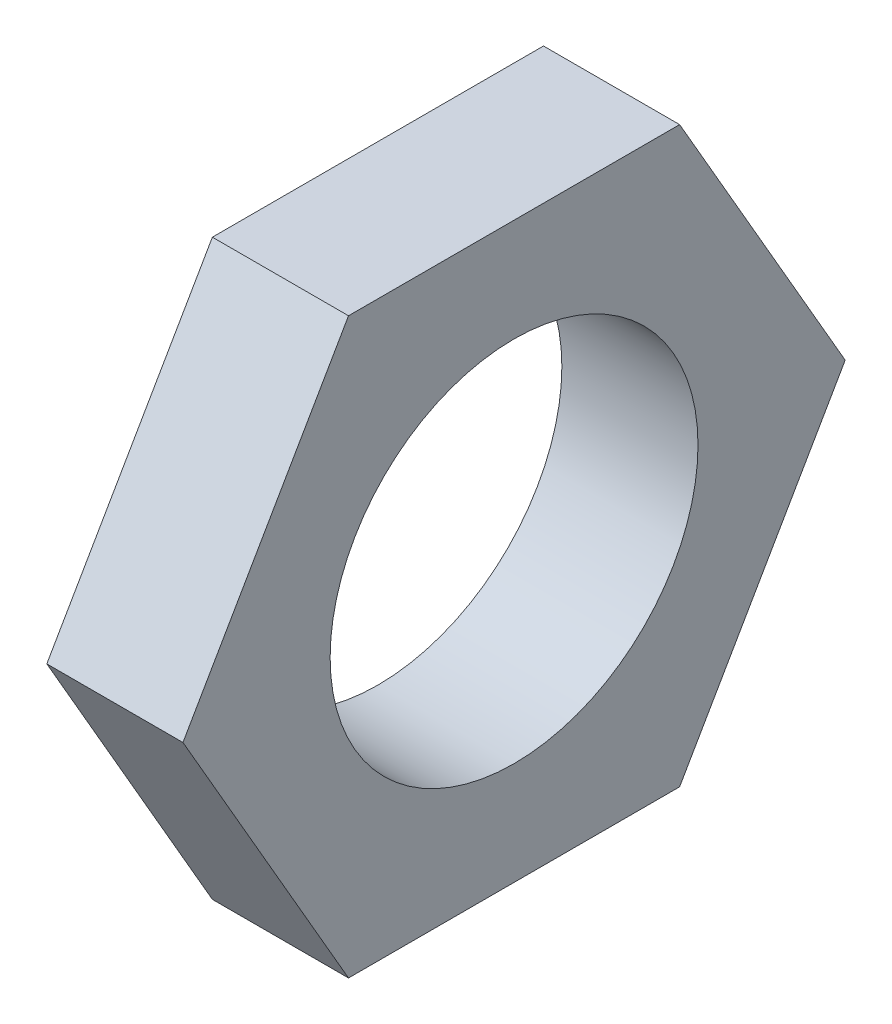
ISO-10303-21;
HEADER;
FILE_DESCRIPTION(('STEP AP214'),'2;1');
FILE_NAME('part.step','',(''),(''),'','','');
FILE_SCHEMA(('AUTOMOTIVE_DESIGN { 1 0 10303 214 1 1 1 1 }'));
ENDSEC;
DATA;
#1=APPLICATION_CONTEXT('core data for automotive mechanical design processes');
#2=APPLICATION_PROTOCOL_DEFINITION('international standard','automotive_design',2000,#1);
#3=PRODUCT_CONTEXT('',#1,'mechanical');
#4=PRODUCT('Part','Part','',(#3));
#5=PRODUCT_RELATED_PRODUCT_CATEGORY('part','',(#4));
#6=PRODUCT_DEFINITION_FORMATION('','',#4);
#7=PRODUCT_DEFINITION_CONTEXT('part definition',#1,'design');
#8=PRODUCT_DEFINITION('design','',#6,#7);
#9=PRODUCT_DEFINITION_SHAPE('','',#8);
#10=(LENGTH_UNIT() NAMED_UNIT(*) SI_UNIT(.MILLI.,.METRE.));
#11=(NAMED_UNIT(*) PLANE_ANGLE_UNIT() SI_UNIT($,.RADIAN.));
#12=(NAMED_UNIT(*) SI_UNIT($,.STERADIAN.) SOLID_ANGLE_UNIT());
#13=UNCERTAINTY_MEASURE_WITH_UNIT(LENGTH_MEASURE(1.E-05),#10,'distance_accuracy_value','');
#14=(GEOMETRIC_REPRESENTATION_CONTEXT(3) GLOBAL_UNCERTAINTY_ASSIGNED_CONTEXT((#13)) GLOBAL_UNIT_ASSIGNED_CONTEXT((#10,
#11,#12)) REPRESENTATION_CONTEXT('',''));
#15=CARTESIAN_POINT('',(0.,0.,0.));
#16=DIRECTION('',(0.,0.,1.));
#17=DIRECTION('',(1.,0.,0.));
#18=AXIS2_PLACEMENT_3D('',#15,#16,#17);
#19=CARTESIAN_POINT('',(2.35,0.,0.));
#20=DIRECTION('',(1.,0.,0.));
#21=DIRECTION('',(0.,0.,-1.));
#22=AXIS2_PLACEMENT_3D('',#19,#20,#21);
#23=PLANE('',#22);
#24=DIRECTION('',(0.,0.866025403784442,-0.499999999999995));
#25=VECTOR('',#24,1.);
#26=CARTESIAN_POINT('',(2.35,-4.94999999999997,-2.85788383248871));
#27=LINE('',#26,#25);
#28=CARTESIAN_POINT('',(2.35,-4.94999999999997,-2.85788383248871));
#29=VERTEX_POINT('',#28);
#30=CARTESIAN_POINT('',(2.35,0.,-5.7157676649773));
#31=VERTEX_POINT('',#30);
#32=EDGE_CURVE('E146',#29,#31,#27,.T.);
#33=ORIENTED_EDGE('',*,*,#32,.T.);
#34=DIRECTION('',(0.,0.866025403784438,0.500000000000001));
#35=VECTOR('',#34,1.);
#36=CARTESIAN_POINT('',(2.35,0.,-5.7157676649773));
#37=LINE('',#36,#35);
#38=CARTESIAN_POINT('',(2.35,4.95000000000001,-2.85788383248864));
#39=VERTEX_POINT('',#38);
#40=EDGE_CURVE('E94',#31,#39,#37,.T.);
#41=ORIENTED_EDGE('',*,*,#40,.T.);
#42=DIRECTION('',(0.,0.,1.));
#43=VECTOR('',#42,1.);
#44=CARTESIAN_POINT('',(2.35,4.95000000000001,-2.85788383248864));
#45=LINE('',#44,#43);
#46=CARTESIAN_POINT('',(2.35,4.94999999999999,2.85788383248867));
#47=VERTEX_POINT('',#46);
#48=EDGE_CURVE('E107',#39,#47,#45,.T.);
#49=ORIENTED_EDGE('',*,*,#48,.T.);
#50=DIRECTION('',(0.,-0.866025403784442,0.499999999999995));
#51=VECTOR('',#50,1.);
#52=CARTESIAN_POINT('',(2.35,4.94999999999999,2.85788383248867));
#53=LINE('',#52,#51);
#54=CARTESIAN_POINT('',(2.35,0.,5.7157676649773));
#55=VERTEX_POINT('',#54);
#56=EDGE_CURVE('E101',#47,#55,#53,.T.);
#57=ORIENTED_EDGE('',*,*,#56,.T.);
#58=DIRECTION('',(0.,-0.866025403784435,-0.500000000000007));
#59=VECTOR('',#58,1.);
#60=CARTESIAN_POINT('',(2.35,0.,5.7157676649773));
#61=LINE('',#60,#59);
#62=CARTESIAN_POINT('',(2.35,-4.95000000000003,2.8578838324886));
#63=VERTEX_POINT('',#62);
#64=EDGE_CURVE('E105',#55,#63,#61,.T.);
#65=ORIENTED_EDGE('',*,*,#64,.T.);
#66=DIRECTION('',(0.,0.,-1.));
#67=VECTOR('',#66,1.);
#68=CARTESIAN_POINT('',(2.35,-4.95000000000003,2.8578838324886));
#69=LINE('',#68,#67);
#70=EDGE_CURVE('E57',#63,#29,#69,.T.);
#71=ORIENTED_EDGE('',*,*,#70,.T.);
#72=EDGE_LOOP('',(#33,#41,#49,#57,#65,#71));
#73=FACE_BOUND('',#72,.T.);
#74=CARTESIAN_POINT('',(2.35,0.,0.));
#75=DIRECTION('',(1.,0.,0.));
#76=DIRECTION('',(0.,0.,-1.));
#77=AXIS2_PLACEMENT_3D('',#74,#75,#76);
#78=CIRCLE('',#77,3.175);
#79=CARTESIAN_POINT('',(2.35,0.,-3.175));
#80=VERTEX_POINT('',#79);
#81=EDGE_CURVE('E134',#80,#80,#78,.T.);
#82=ORIENTED_EDGE('',*,*,#81,.F.);
#83=EDGE_LOOP('',(#82));
#84=FACE_BOUND('',#83,.T.);
#85=ADVANCED_FACE('F39',(#73,#84),#23,.T.);
#86=CARTESIAN_POINT('',(0.,0.,0.));
#87=DIRECTION('',(1.,0.,0.));
#88=DIRECTION('',(0.,0.,-1.));
#89=AXIS2_PLACEMENT_3D('',#86,#87,#88);
#90=PLANE('',#89);
#91=DIRECTION('',(0.,0.866025403784442,-0.499999999999995));
#92=VECTOR('',#91,1.);
#93=CARTESIAN_POINT('',(0.,-4.94999999999997,-2.85788383248871));
#94=LINE('',#93,#92);
#95=CARTESIAN_POINT('',(0.,-4.94999999999997,-2.85788383248871));
#96=VERTEX_POINT('',#95);
#97=CARTESIAN_POINT('',(0.,0.,-5.7157676649773));
#98=VERTEX_POINT('',#97);
#99=EDGE_CURVE('E129',#96,#98,#94,.T.);
#100=ORIENTED_EDGE('',*,*,#99,.F.);
#101=DIRECTION('',(0.,0.,-1.));
#102=VECTOR('',#101,1.);
#103=CARTESIAN_POINT('',(0.,-4.95000000000003,2.8578838324886));
#104=LINE('',#103,#102);
#105=CARTESIAN_POINT('',(0.,-4.95000000000003,2.8578838324886));
#106=VERTEX_POINT('',#105);
#107=EDGE_CURVE('E86',#106,#96,#104,.T.);
#108=ORIENTED_EDGE('',*,*,#107,.F.);
#109=DIRECTION('',(0.,-0.866025403784435,-0.500000000000007));
#110=VECTOR('',#109,1.);
#111=CARTESIAN_POINT('',(0.,0.,5.7157676649773));
#112=LINE('',#111,#110);
#113=CARTESIAN_POINT('',(0.,0.,5.7157676649773));
#114=VERTEX_POINT('',#113);
#115=EDGE_CURVE('E80',#114,#106,#112,.T.);
#116=ORIENTED_EDGE('',*,*,#115,.F.);
#117=DIRECTION('',(0.,-0.866025403784442,0.499999999999995));
#118=VECTOR('',#117,1.);
#119=CARTESIAN_POINT('',(0.,4.94999999999999,2.85788383248867));
#120=LINE('',#119,#118);
#121=CARTESIAN_POINT('',(0.,4.94999999999999,2.85788383248867));
#122=VERTEX_POINT('',#121);
#123=EDGE_CURVE('E116',#122,#114,#120,.T.);
#124=ORIENTED_EDGE('',*,*,#123,.F.);
#125=DIRECTION('',(0.,0.,1.));
#126=VECTOR('',#125,1.);
#127=CARTESIAN_POINT('',(0.,4.95000000000001,-2.85788383248864));
#128=LINE('',#127,#126);
#129=CARTESIAN_POINT('',(0.,4.95000000000001,-2.85788383248864));
#130=VERTEX_POINT('',#129);
#131=EDGE_CURVE('E137',#130,#122,#128,.T.);
#132=ORIENTED_EDGE('',*,*,#131,.F.);
#133=DIRECTION('',(0.,0.866025403784438,0.500000000000001));
#134=VECTOR('',#133,1.);
#135=CARTESIAN_POINT('',(0.,0.,-5.7157676649773));
#136=LINE('',#135,#134);
#137=EDGE_CURVE('E133',#98,#130,#136,.T.);
#138=ORIENTED_EDGE('',*,*,#137,.F.);
#139=EDGE_LOOP('',(#100,#108,#116,#124,#132,#138));
#140=FACE_BOUND('',#139,.T.);
#141=CARTESIAN_POINT('',(0.,0.,0.));
#142=DIRECTION('',(1.,0.,0.));
#143=DIRECTION('',(0.,0.,-1.));
#144=AXIS2_PLACEMENT_3D('',#141,#142,#143);
#145=CIRCLE('',#144,3.175);
#146=CARTESIAN_POINT('',(0.,0.,-3.175));
#147=VERTEX_POINT('',#146);
#148=EDGE_CURVE('E243',#147,#147,#145,.T.);
#149=ORIENTED_EDGE('',*,*,#148,.T.);
#150=EDGE_LOOP('',(#149));
#151=FACE_BOUND('',#150,.T.);
#152=ADVANCED_FACE('F159',(#140,#151),#90,.F.);
#153=CARTESIAN_POINT('',(2.35,-4.94999999999997,-2.85788383248871));
#154=DIRECTION('',(0.,0.499999999999995,0.866025403784442));
#155=DIRECTION('',(0.,-0.866025403784442,0.499999999999995));
#156=AXIS2_PLACEMENT_3D('',#153,#154,#155);
#157=PLANE('',#156);
#158=ORIENTED_EDGE('',*,*,#99,.T.);
#159=DIRECTION('',(-1.,0.,0.));
#160=VECTOR('',#159,1.);
#161=CARTESIAN_POINT('',(2.35,0.,-5.7157676649773));
#162=LINE('',#161,#160);
#163=EDGE_CURVE('E11',#31,#98,#162,.T.);
#164=ORIENTED_EDGE('',*,*,#163,.F.);
#165=ORIENTED_EDGE('',*,*,#32,.F.);
#166=DIRECTION('',(-1.,0.,0.));
#167=VECTOR('',#166,1.);
#168=CARTESIAN_POINT('',(2.35,-4.94999999999997,-2.85788383248871));
#169=LINE('',#168,#167);
#170=EDGE_CURVE('E125',#29,#96,#169,.T.);
#171=ORIENTED_EDGE('',*,*,#170,.T.);
#172=EDGE_LOOP('',(#158,#164,#165,#171));
#173=FACE_BOUND('',#172,.T.);
#174=ADVANCED_FACE('F41',(#173),#157,.F.);
#175=CARTESIAN_POINT('',(2.35,0.,-5.7157676649773));
#176=DIRECTION('',(0.,-0.500000000000001,0.866025403784438));
#177=DIRECTION('',(0.,-0.866025403784438,-0.500000000000001));
#178=AXIS2_PLACEMENT_3D('',#175,#176,#177);
#179=PLANE('',#178);
#180=ORIENTED_EDGE('',*,*,#137,.T.);
#181=DIRECTION('',(-1.,0.,0.));
#182=VECTOR('',#181,1.);
#183=CARTESIAN_POINT('',(2.35,4.95000000000001,-2.85788383248864));
#184=LINE('',#183,#182);
#185=EDGE_CURVE('E49',#39,#130,#184,.T.);
#186=ORIENTED_EDGE('',*,*,#185,.F.);
#187=ORIENTED_EDGE('',*,*,#40,.F.);
#188=ORIENTED_EDGE('',*,*,#163,.T.);
#189=EDGE_LOOP('',(#180,#186,#187,#188));
#190=FACE_BOUND('',#189,.T.);
#191=ADVANCED_FACE('F184',(#190),#179,.F.);
#192=CARTESIAN_POINT('',(2.35,4.95000000000001,-2.85788383248864));
#193=DIRECTION('',(0.,-1.,0.));
#194=DIRECTION('',(0.,0.,-1.));
#195=AXIS2_PLACEMENT_3D('',#192,#193,#194);
#196=PLANE('',#195);
#197=ORIENTED_EDGE('',*,*,#131,.T.);
#198=DIRECTION('',(-1.,0.,0.));
#199=VECTOR('',#198,1.);
#200=CARTESIAN_POINT('',(2.35,4.94999999999999,2.85788383248867));
#201=LINE('',#200,#199);
#202=EDGE_CURVE('E118',#47,#122,#201,.T.);
#203=ORIENTED_EDGE('',*,*,#202,.F.);
#204=ORIENTED_EDGE('',*,*,#48,.F.);
#205=ORIENTED_EDGE('',*,*,#185,.T.);
#206=EDGE_LOOP('',(#197,#203,#204,#205));
#207=FACE_BOUND('',#206,.T.);
#208=ADVANCED_FACE('F156',(#207),#196,.F.);
#209=CARTESIAN_POINT('',(2.35,4.94999999999999,2.85788383248867));
#210=DIRECTION('',(0.,-0.499999999999995,-0.866025403784442));
#211=DIRECTION('',(0.,0.866025403784442,-0.499999999999995));
#212=AXIS2_PLACEMENT_3D('',#209,#210,#211);
#213=PLANE('',#212);
#214=ORIENTED_EDGE('',*,*,#123,.T.);
#215=DIRECTION('',(-1.,0.,0.));
#216=VECTOR('',#215,1.);
#217=CARTESIAN_POINT('',(2.35,0.,5.7157676649773));
#218=LINE('',#217,#216);
#219=EDGE_CURVE('E113',#55,#114,#218,.T.);
#220=ORIENTED_EDGE('',*,*,#219,.F.);
#221=ORIENTED_EDGE('',*,*,#56,.F.);
#222=ORIENTED_EDGE('',*,*,#202,.T.);
#223=EDGE_LOOP('',(#214,#220,#221,#222));
#224=FACE_BOUND('',#223,.T.);
#225=ADVANCED_FACE('F114',(#224),#213,.F.);
#226=CARTESIAN_POINT('',(2.35,0.,5.7157676649773));
#227=DIRECTION('',(0.,0.500000000000007,-0.866025403784435));
#228=DIRECTION('',(0.,0.866025403784435,0.500000000000007));
#229=AXIS2_PLACEMENT_3D('',#226,#227,#228);
#230=PLANE('',#229);
#231=ORIENTED_EDGE('',*,*,#115,.T.);
#232=DIRECTION('',(-1.,0.,0.));
#233=VECTOR('',#232,1.);
#234=CARTESIAN_POINT('',(2.35,-4.95000000000003,2.8578838324886));
#235=LINE('',#234,#233);
#236=EDGE_CURVE('E119',#63,#106,#235,.T.);
#237=ORIENTED_EDGE('',*,*,#236,.F.);
#238=ORIENTED_EDGE('',*,*,#64,.F.);
#239=ORIENTED_EDGE('',*,*,#219,.T.);
#240=EDGE_LOOP('',(#231,#237,#238,#239));
#241=FACE_BOUND('',#240,.T.);
#242=ADVANCED_FACE('F121',(#241),#230,.F.);
#243=CARTESIAN_POINT('',(2.35,-4.95000000000003,2.8578838324886));
#244=DIRECTION('',(0.,1.,0.));
#245=DIRECTION('',(0.,0.,1.));
#246=AXIS2_PLACEMENT_3D('',#243,#244,#245);
#247=PLANE('',#246);
#248=ORIENTED_EDGE('',*,*,#107,.T.);
#249=ORIENTED_EDGE('',*,*,#170,.F.);
#250=ORIENTED_EDGE('',*,*,#70,.F.);
#251=ORIENTED_EDGE('',*,*,#236,.T.);
#252=EDGE_LOOP('',(#248,#249,#250,#251));
#253=FACE_BOUND('',#252,.T.);
#254=ADVANCED_FACE('F164',(#253),#247,.F.);
#255=CARTESIAN_POINT('',(2.35,0.,0.));
#256=DIRECTION('',(-1.,0.,0.));
#257=DIRECTION('',(0.,0.,1.));
#258=AXIS2_PLACEMENT_3D('',#255,#256,#257);
#259=CYLINDRICAL_SURFACE('',#258,3.175);
#260=ORIENTED_EDGE('',*,*,#81,.T.);
#261=EDGE_LOOP('',(#260));
#262=FACE_BOUND('',#261,.T.);
#263=ORIENTED_EDGE('',*,*,#148,.F.);
#264=EDGE_LOOP('',(#263));
#265=FACE_BOUND('',#264,.T.);
#266=ADVANCED_FACE('F166',(#262,#265),#259,.F.);
#267=CLOSED_SHELL('',(#85,#152,#174,#191,#208,#225,#242,#254,#266));
#268=MANIFOLD_SOLID_BREP('B2',#267);
#269=ADVANCED_BREP_SHAPE_REPRESENTATION('',(#18,#268),#14);
#270=SHAPE_DEFINITION_REPRESENTATION(#9,#269);
ENDSEC;
END-ISO-10303-21;
